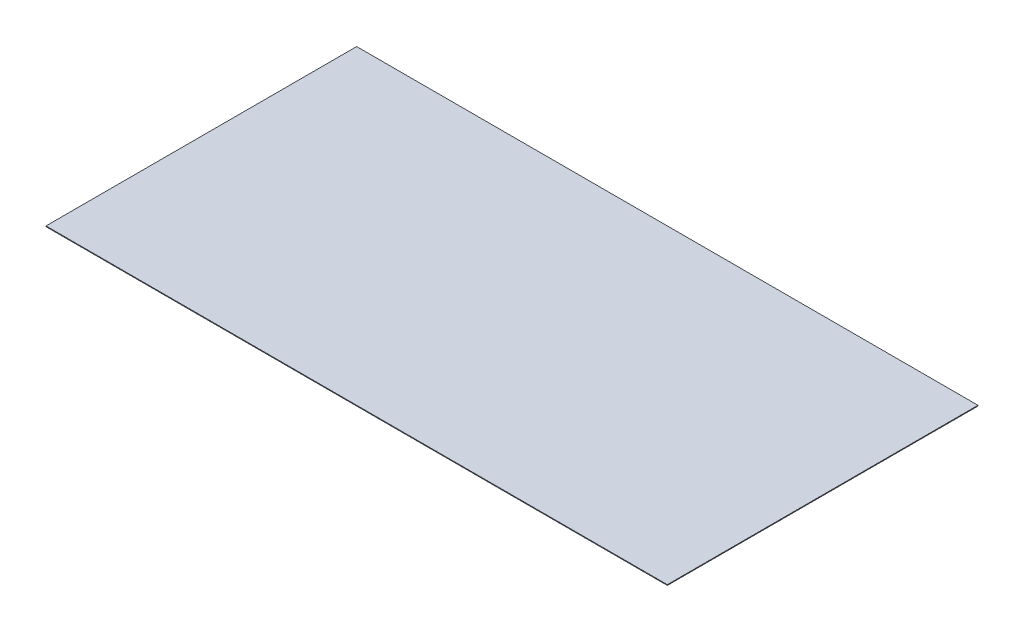
ISO-10303-21;
HEADER;
FILE_DESCRIPTION(('STEP AP214'),'2;1');
FILE_NAME('part.step','',(''),(''),'','','');
FILE_SCHEMA(('AUTOMOTIVE_DESIGN { 1 0 10303 214 1 1 1 1 }'));
ENDSEC;
DATA;
#1=APPLICATION_CONTEXT('core data for automotive mechanical design processes');
#2=APPLICATION_PROTOCOL_DEFINITION('international standard','automotive_design',2000,#1);
#3=PRODUCT_CONTEXT('',#1,'mechanical');
#4=PRODUCT('Part','Part','',(#3));
#5=PRODUCT_RELATED_PRODUCT_CATEGORY('part','',(#4));
#6=PRODUCT_DEFINITION_FORMATION('','',#4);
#7=PRODUCT_DEFINITION_CONTEXT('part definition',#1,'design');
#8=PRODUCT_DEFINITION('design','',#6,#7);
#9=PRODUCT_DEFINITION_SHAPE('','',#8);
#10=(LENGTH_UNIT() NAMED_UNIT(*) SI_UNIT(.MILLI.,.METRE.));
#11=(NAMED_UNIT(*) PLANE_ANGLE_UNIT() SI_UNIT($,.RADIAN.));
#12=(NAMED_UNIT(*) SI_UNIT($,.STERADIAN.) SOLID_ANGLE_UNIT());
#13=UNCERTAINTY_MEASURE_WITH_UNIT(LENGTH_MEASURE(1.E-05),#10,'distance_accuracy_value','');
#14=(GEOMETRIC_REPRESENTATION_CONTEXT(3) GLOBAL_UNCERTAINTY_ASSIGNED_CONTEXT((#13)) GLOBAL_UNIT_ASSIGNED_CONTEXT((#10,
#11,#12)) REPRESENTATION_CONTEXT('',''));
#15=CARTESIAN_POINT('',(0.,0.,0.));
#16=DIRECTION('',(0.,0.,1.));
#17=DIRECTION('',(1.,0.,0.));
#18=AXIS2_PLACEMENT_3D('',#15,#16,#17);
#19=CARTESIAN_POINT('',(450.,1.,-225.));
#20=DIRECTION('',(-1.,0.,0.));
#21=DIRECTION('',(0.,0.,1.));
#22=AXIS2_PLACEMENT_3D('',#19,#20,#21);
#23=PLANE('',#22);
#24=DIRECTION('',(0.,0.,-1.));
#25=VECTOR('',#24,1.);
#26=CARTESIAN_POINT('',(450.,0.,-225.));
#27=LINE('',#26,#25);
#28=CARTESIAN_POINT('',(450.,0.,225.));
#29=VERTEX_POINT('',#28);
#30=CARTESIAN_POINT('',(450.,0.,-225.));
#31=VERTEX_POINT('',#30);
#32=EDGE_CURVE('E95',#29,#31,#27,.T.);
#33=ORIENTED_EDGE('',*,*,#32,.T.);
#34=DIRECTION('',(0.,-1.,0.));
#35=VECTOR('',#34,1.);
#36=CARTESIAN_POINT('',(450.,1.,-225.));
#37=LINE('',#36,#35);
#38=CARTESIAN_POINT('',(450.,1.,-225.));
#39=VERTEX_POINT('',#38);
#40=EDGE_CURVE('E11',#39,#31,#37,.T.);
#41=ORIENTED_EDGE('',*,*,#40,.F.);
#42=DIRECTION('',(0.,0.,-1.));
#43=VECTOR('',#42,1.);
#44=CARTESIAN_POINT('',(450.,1.,-225.));
#45=LINE('',#44,#43);
#46=CARTESIAN_POINT('',(450.,1.,225.));
#47=VERTEX_POINT('',#46);
#48=EDGE_CURVE('E83',#47,#39,#45,.T.);
#49=ORIENTED_EDGE('',*,*,#48,.F.);
#50=DIRECTION('',(0.,-1.,0.));
#51=VECTOR('',#50,1.);
#52=CARTESIAN_POINT('',(450.,1.,225.));
#53=LINE('',#52,#51);
#54=EDGE_CURVE('E91',#47,#29,#53,.T.);
#55=ORIENTED_EDGE('',*,*,#54,.T.);
#56=EDGE_LOOP('',(#33,#41,#49,#55));
#57=FACE_BOUND('',#56,.T.);
#58=ADVANCED_FACE('F32',(#57),#23,.F.);
#59=CARTESIAN_POINT('',(-450.,1.,-225.));
#60=DIRECTION('',(0.,0.,1.));
#61=DIRECTION('',(1.,0.,0.));
#62=AXIS2_PLACEMENT_3D('',#59,#60,#61);
#63=PLANE('',#62);
#64=DIRECTION('',(-1.,0.,0.));
#65=VECTOR('',#64,1.);
#66=CARTESIAN_POINT('',(-450.,0.,-225.));
#67=LINE('',#66,#65);
#68=CARTESIAN_POINT('',(-450.,0.,-225.));
#69=VERTEX_POINT('',#68);
#70=EDGE_CURVE('E87',#31,#69,#67,.T.);
#71=ORIENTED_EDGE('',*,*,#70,.T.);
#72=DIRECTION('',(0.,-1.,0.));
#73=VECTOR('',#72,1.);
#74=CARTESIAN_POINT('',(-450.,1.,-225.));
#75=LINE('',#74,#73);
#76=CARTESIAN_POINT('',(-450.,1.,-225.));
#77=VERTEX_POINT('',#76);
#78=EDGE_CURVE('E40',#77,#69,#75,.T.);
#79=ORIENTED_EDGE('',*,*,#78,.F.);
#80=DIRECTION('',(-1.,0.,0.));
#81=VECTOR('',#80,1.);
#82=CARTESIAN_POINT('',(-450.,1.,-225.));
#83=LINE('',#82,#81);
#84=EDGE_CURVE('E78',#39,#77,#83,.T.);
#85=ORIENTED_EDGE('',*,*,#84,.F.);
#86=ORIENTED_EDGE('',*,*,#40,.T.);
#87=EDGE_LOOP('',(#71,#79,#85,#86));
#88=FACE_BOUND('',#87,.T.);
#89=ADVANCED_FACE('F86',(#88),#63,.F.);
#90=CARTESIAN_POINT('',(-450.,1.,-225.));
#91=DIRECTION('',(1.,0.,0.));
#92=DIRECTION('',(0.,0.,-1.));
#93=AXIS2_PLACEMENT_3D('',#90,#91,#92);
#94=PLANE('',#93);
#95=DIRECTION('',(0.,0.,1.));
#96=VECTOR('',#95,1.);
#97=CARTESIAN_POINT('',(-450.,0.,-225.));
#98=LINE('',#97,#96);
#99=CARTESIAN_POINT('',(-450.,0.,225.));
#100=VERTEX_POINT('',#99);
#101=EDGE_CURVE('E65',#69,#100,#98,.T.);
#102=ORIENTED_EDGE('',*,*,#101,.T.);
#103=DIRECTION('',(0.,-1.,0.));
#104=VECTOR('',#103,1.);
#105=CARTESIAN_POINT('',(-450.,1.,225.));
#106=LINE('',#105,#104);
#107=CARTESIAN_POINT('',(-450.,1.,225.));
#108=VERTEX_POINT('',#107);
#109=EDGE_CURVE('E88',#108,#100,#106,.T.);
#110=ORIENTED_EDGE('',*,*,#109,.F.);
#111=DIRECTION('',(0.,0.,1.));
#112=VECTOR('',#111,1.);
#113=CARTESIAN_POINT('',(-450.,1.,-225.));
#114=LINE('',#113,#112);
#115=EDGE_CURVE('E81',#77,#108,#114,.T.);
#116=ORIENTED_EDGE('',*,*,#115,.F.);
#117=ORIENTED_EDGE('',*,*,#78,.T.);
#118=EDGE_LOOP('',(#102,#110,#116,#117));
#119=FACE_BOUND('',#118,.T.);
#120=ADVANCED_FACE('F89',(#119),#94,.F.);
#121=CARTESIAN_POINT('',(-450.,1.,225.));
#122=DIRECTION('',(0.,0.,-1.));
#123=DIRECTION('',(-1.,0.,0.));
#124=AXIS2_PLACEMENT_3D('',#121,#122,#123);
#125=PLANE('',#124);
#126=DIRECTION('',(1.,0.,0.));
#127=VECTOR('',#126,1.);
#128=CARTESIAN_POINT('',(-450.,0.,225.));
#129=LINE('',#128,#127);
#130=EDGE_CURVE('E71',#100,#29,#129,.T.);
#131=ORIENTED_EDGE('',*,*,#130,.T.);
#132=ORIENTED_EDGE('',*,*,#54,.F.);
#133=DIRECTION('',(1.,0.,0.));
#134=VECTOR('',#133,1.);
#135=CARTESIAN_POINT('',(-450.,1.,225.));
#136=LINE('',#135,#134);
#137=EDGE_CURVE('E48',#108,#47,#136,.T.);
#138=ORIENTED_EDGE('',*,*,#137,.F.);
#139=ORIENTED_EDGE('',*,*,#109,.T.);
#140=EDGE_LOOP('',(#131,#132,#138,#139));
#141=FACE_BOUND('',#140,.T.);
#142=ADVANCED_FACE('F102',(#141),#125,.F.);
#143=CARTESIAN_POINT('',(0.,1.,0.));
#144=DIRECTION('',(0.,1.,0.));
#145=DIRECTION('',(0.,0.,1.));
#146=AXIS2_PLACEMENT_3D('',#143,#144,#145);
#147=PLANE('',#146);
#148=ORIENTED_EDGE('',*,*,#48,.T.);
#149=ORIENTED_EDGE('',*,*,#84,.T.);
#150=ORIENTED_EDGE('',*,*,#115,.T.);
#151=ORIENTED_EDGE('',*,*,#137,.T.);
#152=EDGE_LOOP('',(#148,#149,#150,#151));
#153=FACE_BOUND('',#152,.T.);
#154=ADVANCED_FACE('F79',(#153),#147,.T.);
#155=CARTESIAN_POINT('',(0.,0.,0.));
#156=DIRECTION('',(0.,1.,0.));
#157=DIRECTION('',(0.,0.,1.));
#158=AXIS2_PLACEMENT_3D('',#155,#156,#157);
#159=PLANE('',#158);
#160=ORIENTED_EDGE('',*,*,#32,.F.);
#161=ORIENTED_EDGE('',*,*,#130,.F.);
#162=ORIENTED_EDGE('',*,*,#101,.F.);
#163=ORIENTED_EDGE('',*,*,#70,.F.);
#164=EDGE_LOOP('',(#160,#161,#162,#163));
#165=FACE_BOUND('',#164,.T.);
#166=ADVANCED_FACE('F105',(#165),#159,.F.);
#167=CLOSED_SHELL('',(#58,#89,#120,#142,#154,#166));
#168=MANIFOLD_SOLID_BREP('B2',#167);
#169=ADVANCED_BREP_SHAPE_REPRESENTATION('',(#18,#168),#14);
#170=SHAPE_DEFINITION_REPRESENTATION(#9,#169);
ENDSEC;
END-ISO-10303-21;
